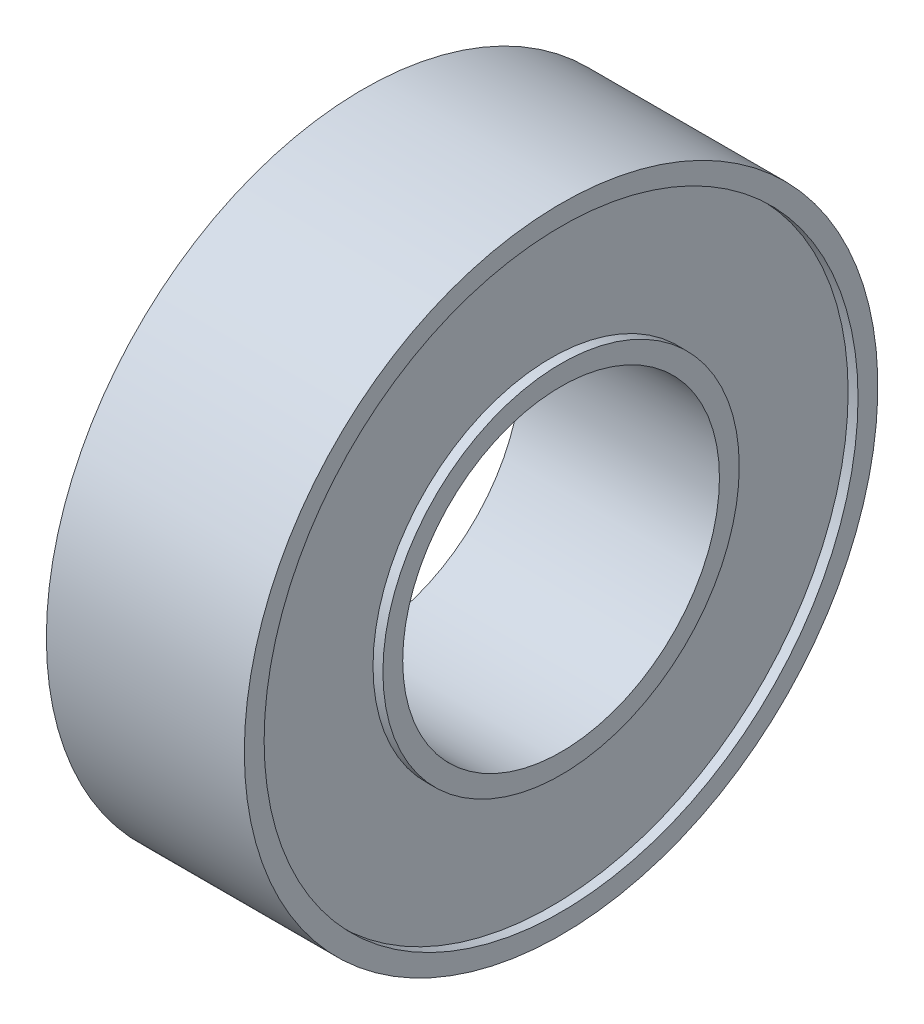
ISO-10303-21;
HEADER;
FILE_DESCRIPTION(('STEP AP214'),'2;1');
FILE_NAME('part.step','',(''),(''),'','','');
FILE_SCHEMA(('AUTOMOTIVE_DESIGN { 1 0 10303 214 1 1 1 1 }'));
ENDSEC;
DATA;
#1=APPLICATION_CONTEXT('core data for automotive mechanical design processes');
#2=APPLICATION_PROTOCOL_DEFINITION('international standard','automotive_design',2000,#1);
#3=PRODUCT_CONTEXT('',#1,'mechanical');
#4=PRODUCT('Part','Part','',(#3));
#5=PRODUCT_RELATED_PRODUCT_CATEGORY('part','',(#4));
#6=PRODUCT_DEFINITION_FORMATION('','',#4);
#7=PRODUCT_DEFINITION_CONTEXT('part definition',#1,'design');
#8=PRODUCT_DEFINITION('design','',#6,#7);
#9=PRODUCT_DEFINITION_SHAPE('','',#8);
#10=(LENGTH_UNIT() NAMED_UNIT(*) SI_UNIT(.MILLI.,.METRE.));
#11=(NAMED_UNIT(*) PLANE_ANGLE_UNIT() SI_UNIT($,.RADIAN.));
#12=(NAMED_UNIT(*) SI_UNIT($,.STERADIAN.) SOLID_ANGLE_UNIT());
#13=UNCERTAINTY_MEASURE_WITH_UNIT(LENGTH_MEASURE(1.E-05),#10,'distance_accuracy_value','');
#14=(GEOMETRIC_REPRESENTATION_CONTEXT(3) GLOBAL_UNCERTAINTY_ASSIGNED_CONTEXT((#13)) GLOBAL_UNIT_ASSIGNED_CONTEXT((#10,
#11,#12)) REPRESENTATION_CONTEXT('',''));
#15=CARTESIAN_POINT('',(0.,0.,0.));
#16=DIRECTION('',(0.,0.,1.));
#17=DIRECTION('',(1.,0.,0.));
#18=AXIS2_PLACEMENT_3D('',#15,#16,#17);
#19=CARTESIAN_POINT('',(2.5,8.,0.));
#20=DIRECTION('',(-1.,0.,0.));
#21=DIRECTION('',(0.,0.,1.));
#22=AXIS2_PLACEMENT_3D('',#19,#20,#21);
#23=PLANE('',#22);
#24=CARTESIAN_POINT('',(2.5,0.,0.));
#25=DIRECTION('',(-1.,0.,0.));
#26=DIRECTION('',(0.,0.,1.));
#27=AXIS2_PLACEMENT_3D('',#24,#25,#26);
#28=CIRCLE('',#27,8.);
#29=CARTESIAN_POINT('',(2.5,0.,8.));
#30=VERTEX_POINT('',#29);
#31=EDGE_CURVE('E83',#30,#30,#28,.T.);
#32=ORIENTED_EDGE('',*,*,#31,.F.);
#33=EDGE_LOOP('',(#32));
#34=FACE_BOUND('',#33,.T.);
#35=CARTESIAN_POINT('',(2.5,0.,0.));
#36=DIRECTION('',(-1.,0.,0.));
#37=DIRECTION('',(0.,0.,1.));
#38=AXIS2_PLACEMENT_3D('',#35,#36,#37);
#39=CIRCLE('',#38,7.5);
#40=CARTESIAN_POINT('',(2.5,0.,7.5));
#41=VERTEX_POINT('',#40);
#42=EDGE_CURVE('E10',#41,#41,#39,.T.);
#43=ORIENTED_EDGE('',*,*,#42,.T.);
#44=EDGE_LOOP('',(#43));
#45=FACE_BOUND('',#44,.T.);
#46=ADVANCED_FACE('F32',(#34,#45),#23,.F.);
#47=CARTESIAN_POINT('',(0.,0.,0.));
#48=DIRECTION('',(-1.,0.,0.));
#49=DIRECTION('',(0.,0.,1.));
#50=AXIS2_PLACEMENT_3D('',#47,#48,#49);
#51=CYLINDRICAL_SURFACE('',#50,7.5);
#52=ORIENTED_EDGE('',*,*,#42,.F.);
#53=EDGE_LOOP('',(#52));
#54=FACE_BOUND('',#53,.T.);
#55=CARTESIAN_POINT('',(2.25,0.,0.));
#56=DIRECTION('',(-1.,0.,0.));
#57=DIRECTION('',(0.,0.,1.));
#58=AXIS2_PLACEMENT_3D('',#55,#56,#57);
#59=CIRCLE('',#58,7.5);
#60=CARTESIAN_POINT('',(2.25,0.,7.5));
#61=VERTEX_POINT('',#60);
#62=EDGE_CURVE('E39',#61,#61,#59,.T.);
#63=ORIENTED_EDGE('',*,*,#62,.T.);
#64=EDGE_LOOP('',(#63));
#65=FACE_BOUND('',#64,.T.);
#66=ADVANCED_FACE('F91',(#54,#65),#51,.F.);
#67=CARTESIAN_POINT('',(2.25,7.5,0.));
#68=DIRECTION('',(-1.,0.,0.));
#69=DIRECTION('',(0.,0.,1.));
#70=AXIS2_PLACEMENT_3D('',#67,#68,#69);
#71=PLANE('',#70);
#72=ORIENTED_EDGE('',*,*,#62,.F.);
#73=EDGE_LOOP('',(#72));
#74=FACE_BOUND('',#73,.T.);
#75=CARTESIAN_POINT('',(2.25,0.,0.));
#76=DIRECTION('',(-1.,0.,0.));
#77=DIRECTION('',(0.,0.,1.));
#78=AXIS2_PLACEMENT_3D('',#75,#76,#77);
#79=CIRCLE('',#78,4.5);
#80=CARTESIAN_POINT('',(2.25,0.,4.5));
#81=VERTEX_POINT('',#80);
#82=EDGE_CURVE('E46',#81,#81,#79,.T.);
#83=ORIENTED_EDGE('',*,*,#82,.T.);
#84=EDGE_LOOP('',(#83));
#85=FACE_BOUND('',#84,.T.);
#86=ADVANCED_FACE('F95',(#74,#85),#71,.F.);
#87=CARTESIAN_POINT('',(0.,0.,0.));
#88=DIRECTION('',(-1.,0.,0.));
#89=DIRECTION('',(0.,0.,1.));
#90=AXIS2_PLACEMENT_3D('',#87,#88,#89);
#91=CYLINDRICAL_SURFACE('',#90,4.5);
#92=ORIENTED_EDGE('',*,*,#82,.F.);
#93=EDGE_LOOP('',(#92));
#94=FACE_BOUND('',#93,.T.);
#95=CARTESIAN_POINT('',(2.5,0.,0.));
#96=DIRECTION('',(-1.,0.,0.));
#97=DIRECTION('',(0.,0.,1.));
#98=AXIS2_PLACEMENT_3D('',#95,#96,#97);
#99=CIRCLE('',#98,4.5);
#100=CARTESIAN_POINT('',(2.5,0.,4.5));
#101=VERTEX_POINT('',#100);
#102=EDGE_CURVE('E53',#101,#101,#99,.T.);
#103=ORIENTED_EDGE('',*,*,#102,.T.);
#104=EDGE_LOOP('',(#103));
#105=FACE_BOUND('',#104,.T.);
#106=ADVANCED_FACE('F100',(#94,#105),#91,.T.);
#107=CARTESIAN_POINT('',(2.5,4.5,0.));
#108=DIRECTION('',(-1.,0.,0.));
#109=DIRECTION('',(0.,0.,1.));
#110=AXIS2_PLACEMENT_3D('',#107,#108,#109);
#111=PLANE('',#110);
#112=ORIENTED_EDGE('',*,*,#102,.F.);
#113=EDGE_LOOP('',(#112));
#114=FACE_BOUND('',#113,.T.);
#115=CARTESIAN_POINT('',(2.5,0.,0.));
#116=DIRECTION('',(-1.,0.,0.));
#117=DIRECTION('',(0.,0.,1.));
#118=AXIS2_PLACEMENT_3D('',#115,#116,#117);
#119=CIRCLE('',#118,4.);
#120=CARTESIAN_POINT('',(2.5,0.,4.));
#121=VERTEX_POINT('',#120);
#122=EDGE_CURVE('E59',#121,#121,#119,.T.);
#123=ORIENTED_EDGE('',*,*,#122,.T.);
#124=EDGE_LOOP('',(#123));
#125=FACE_BOUND('',#124,.T.);
#126=ADVANCED_FACE('F106',(#114,#125),#111,.F.);
#127=CARTESIAN_POINT('',(0.,0.,0.));
#128=DIRECTION('',(-1.,0.,0.));
#129=DIRECTION('',(0.,0.,1.));
#130=AXIS2_PLACEMENT_3D('',#127,#128,#129);
#131=CYLINDRICAL_SURFACE('',#130,4.);
#132=ORIENTED_EDGE('',*,*,#122,.F.);
#133=EDGE_LOOP('',(#132));
#134=FACE_BOUND('',#133,.T.);
#135=CARTESIAN_POINT('',(-2.5,0.,0.));
#136=DIRECTION('',(-1.,0.,0.));
#137=DIRECTION('',(0.,0.,1.));
#138=AXIS2_PLACEMENT_3D('',#135,#136,#137);
#139=CIRCLE('',#138,4.);
#140=CARTESIAN_POINT('',(-2.5,0.,4.));
#141=VERTEX_POINT('',#140);
#142=EDGE_CURVE('E62',#141,#141,#139,.T.);
#143=ORIENTED_EDGE('',*,*,#142,.T.);
#144=EDGE_LOOP('',(#143));
#145=FACE_BOUND('',#144,.T.);
#146=ADVANCED_FACE('F110',(#134,#145),#131,.F.);
#147=CARTESIAN_POINT('',(-2.5,4.5,0.));
#148=DIRECTION('',(1.,0.,0.));
#149=DIRECTION('',(0.,0.,-1.));
#150=AXIS2_PLACEMENT_3D('',#147,#148,#149);
#151=PLANE('',#150);
#152=ORIENTED_EDGE('',*,*,#142,.F.);
#153=EDGE_LOOP('',(#152));
#154=FACE_BOUND('',#153,.T.);
#155=CARTESIAN_POINT('',(-2.5,0.,0.));
#156=DIRECTION('',(-1.,0.,0.));
#157=DIRECTION('',(0.,0.,1.));
#158=AXIS2_PLACEMENT_3D('',#155,#156,#157);
#159=CIRCLE('',#158,4.5);
#160=CARTESIAN_POINT('',(-2.5,0.,4.5));
#161=VERTEX_POINT('',#160);
#162=EDGE_CURVE('E66',#161,#161,#159,.T.);
#163=ORIENTED_EDGE('',*,*,#162,.T.);
#164=EDGE_LOOP('',(#163));
#165=FACE_BOUND('',#164,.T.);
#166=ADVANCED_FACE('F114',(#154,#165),#151,.F.);
#167=CARTESIAN_POINT('',(0.,0.,0.));
#168=DIRECTION('',(-1.,0.,0.));
#169=DIRECTION('',(0.,0.,1.));
#170=AXIS2_PLACEMENT_3D('',#167,#168,#169);
#171=CYLINDRICAL_SURFACE('',#170,4.5);
#172=ORIENTED_EDGE('',*,*,#162,.F.);
#173=EDGE_LOOP('',(#172));
#174=FACE_BOUND('',#173,.T.);
#175=CARTESIAN_POINT('',(-2.25,0.,0.));
#176=DIRECTION('',(-1.,0.,0.));
#177=DIRECTION('',(0.,0.,1.));
#178=AXIS2_PLACEMENT_3D('',#175,#176,#177);
#179=CIRCLE('',#178,4.5);
#180=CARTESIAN_POINT('',(-2.25,0.,4.5));
#181=VERTEX_POINT('',#180);
#182=EDGE_CURVE('E70',#181,#181,#179,.T.);
#183=ORIENTED_EDGE('',*,*,#182,.T.);
#184=EDGE_LOOP('',(#183));
#185=FACE_BOUND('',#184,.T.);
#186=ADVANCED_FACE('F118',(#174,#185),#171,.T.);
#187=CARTESIAN_POINT('',(-2.25,7.5,0.));
#188=DIRECTION('',(1.,0.,0.));
#189=DIRECTION('',(0.,0.,-1.));
#190=AXIS2_PLACEMENT_3D('',#187,#188,#189);
#191=PLANE('',#190);
#192=ORIENTED_EDGE('',*,*,#182,.F.);
#193=EDGE_LOOP('',(#192));
#194=FACE_BOUND('',#193,.T.);
#195=CARTESIAN_POINT('',(-2.25,0.,0.));
#196=DIRECTION('',(-1.,0.,0.));
#197=DIRECTION('',(0.,0.,1.));
#198=AXIS2_PLACEMENT_3D('',#195,#196,#197);
#199=CIRCLE('',#198,7.5);
#200=CARTESIAN_POINT('',(-2.25,0.,7.5));
#201=VERTEX_POINT('',#200);
#202=EDGE_CURVE('E73',#201,#201,#199,.T.);
#203=ORIENTED_EDGE('',*,*,#202,.T.);
#204=EDGE_LOOP('',(#203));
#205=FACE_BOUND('',#204,.T.);
#206=ADVANCED_FACE('F122',(#194,#205),#191,.F.);
#207=CARTESIAN_POINT('',(0.,0.,0.));
#208=DIRECTION('',(-1.,0.,0.));
#209=DIRECTION('',(0.,0.,1.));
#210=AXIS2_PLACEMENT_3D('',#207,#208,#209);
#211=CYLINDRICAL_SURFACE('',#210,7.5);
#212=ORIENTED_EDGE('',*,*,#202,.F.);
#213=EDGE_LOOP('',(#212));
#214=FACE_BOUND('',#213,.T.);
#215=CARTESIAN_POINT('',(-2.5,0.,0.));
#216=DIRECTION('',(-1.,0.,0.));
#217=DIRECTION('',(0.,0.,1.));
#218=AXIS2_PLACEMENT_3D('',#215,#216,#217);
#219=CIRCLE('',#218,7.5);
#220=CARTESIAN_POINT('',(-2.5,0.,7.5));
#221=VERTEX_POINT('',#220);
#222=EDGE_CURVE('E76',#221,#221,#219,.T.);
#223=ORIENTED_EDGE('',*,*,#222,.T.);
#224=EDGE_LOOP('',(#223));
#225=FACE_BOUND('',#224,.T.);
#226=ADVANCED_FACE('F126',(#214,#225),#211,.F.);
#227=CARTESIAN_POINT('',(-2.5,8.,0.));
#228=DIRECTION('',(1.,0.,0.));
#229=DIRECTION('',(0.,0.,-1.));
#230=AXIS2_PLACEMENT_3D('',#227,#228,#229);
#231=PLANE('',#230);
#232=ORIENTED_EDGE('',*,*,#222,.F.);
#233=EDGE_LOOP('',(#232));
#234=FACE_BOUND('',#233,.T.);
#235=CARTESIAN_POINT('',(-2.5,0.,0.));
#236=DIRECTION('',(-1.,0.,0.));
#237=DIRECTION('',(0.,0.,1.));
#238=AXIS2_PLACEMENT_3D('',#235,#236,#237);
#239=CIRCLE('',#238,8.);
#240=CARTESIAN_POINT('',(-2.5,0.,8.));
#241=VERTEX_POINT('',#240);
#242=EDGE_CURVE('E79',#241,#241,#239,.T.);
#243=ORIENTED_EDGE('',*,*,#242,.T.);
#244=EDGE_LOOP('',(#243));
#245=FACE_BOUND('',#244,.T.);
#246=ADVANCED_FACE('F130',(#234,#245),#231,.F.);
#247=CARTESIAN_POINT('',(0.,0.,0.));
#248=DIRECTION('',(-1.,0.,0.));
#249=DIRECTION('',(0.,0.,1.));
#250=AXIS2_PLACEMENT_3D('',#247,#248,#249);
#251=CYLINDRICAL_SURFACE('',#250,8.);
#252=ORIENTED_EDGE('',*,*,#242,.F.);
#253=EDGE_LOOP('',(#252));
#254=FACE_BOUND('',#253,.T.);
#255=ORIENTED_EDGE('',*,*,#31,.T.);
#256=EDGE_LOOP('',(#255));
#257=FACE_BOUND('',#256,.T.);
#258=ADVANCED_FACE('F88',(#254,#257),#251,.T.);
#259=CLOSED_SHELL('',(#46,#66,#86,#106,#126,#146,#166,#186,#206,#226,#246,#258));
#260=MANIFOLD_SOLID_BREP('B2',#259);
#261=ADVANCED_BREP_SHAPE_REPRESENTATION('',(#18,#260),#14);
#262=SHAPE_DEFINITION_REPRESENTATION(#9,#261);
ENDSEC;
END-ISO-10303-21;
